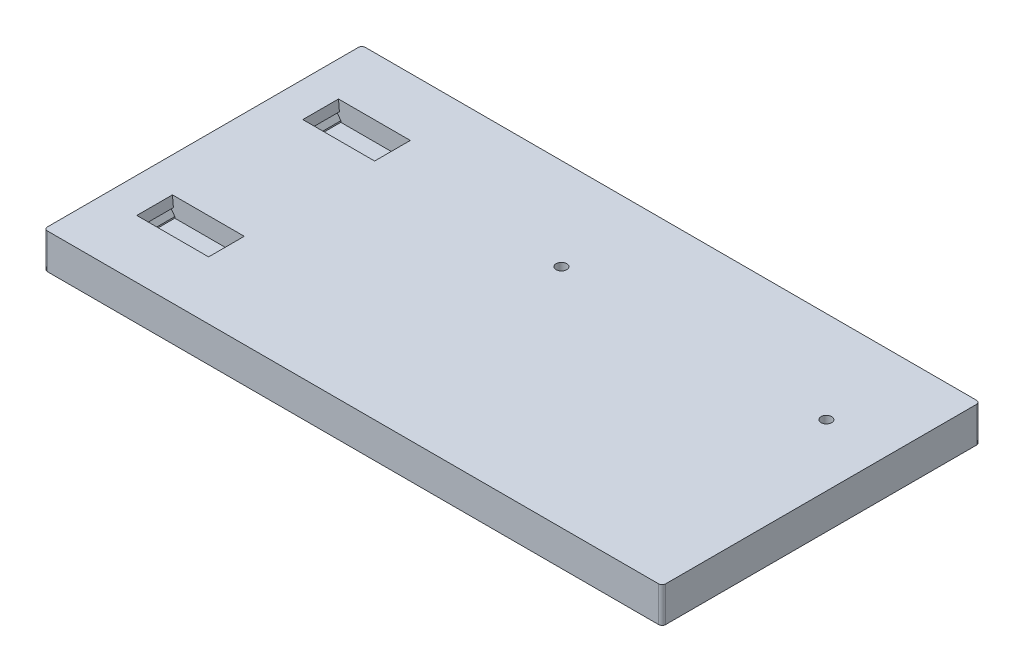
ISO-10303-21;
HEADER;
FILE_DESCRIPTION(('STEP AP214'),'2;1');
FILE_NAME('part.step','',(''),(''),'','','');
FILE_SCHEMA(('AUTOMOTIVE_DESIGN { 1 0 10303 214 1 1 1 1 }'));
ENDSEC;
DATA;
#1=APPLICATION_CONTEXT('core data for automotive mechanical design processes');
#2=APPLICATION_PROTOCOL_DEFINITION('international standard','automotive_design',2000,#1);
#3=PRODUCT_CONTEXT('',#1,'mechanical');
#4=PRODUCT('Part','Part','',(#3));
#5=PRODUCT_RELATED_PRODUCT_CATEGORY('part','',(#4));
#6=PRODUCT_DEFINITION_FORMATION('','',#4);
#7=PRODUCT_DEFINITION_CONTEXT('part definition',#1,'design');
#8=PRODUCT_DEFINITION('design','',#6,#7);
#9=PRODUCT_DEFINITION_SHAPE('','',#8);
#10=(LENGTH_UNIT() NAMED_UNIT(*) SI_UNIT(.MILLI.,.METRE.));
#11=(NAMED_UNIT(*) PLANE_ANGLE_UNIT() SI_UNIT($,.RADIAN.));
#12=(NAMED_UNIT(*) SI_UNIT($,.STERADIAN.) SOLID_ANGLE_UNIT());
#13=UNCERTAINTY_MEASURE_WITH_UNIT(LENGTH_MEASURE(1.E-05),#10,'distance_accuracy_value','');
#14=(GEOMETRIC_REPRESENTATION_CONTEXT(3) GLOBAL_UNCERTAINTY_ASSIGNED_CONTEXT((#13)) GLOBAL_UNIT_ASSIGNED_CONTEXT((#10,
#11,#12)) REPRESENTATION_CONTEXT('',''));
#15=CARTESIAN_POINT('',(0.,0.,0.));
#16=DIRECTION('',(0.,0.,1.));
#17=DIRECTION('',(1.,0.,0.));
#18=AXIS2_PLACEMENT_3D('',#15,#16,#17);
#19=CARTESIAN_POINT('',(0.,10.,0.));
#20=DIRECTION('',(0.,1.,0.));
#21=DIRECTION('',(0.,0.,1.));
#22=AXIS2_PLACEMENT_3D('',#19,#20,#21);
#23=PLANE('',#22);
#24=CARTESIAN_POINT('',(-4.99999999999998,10.,-19.));
#25=DIRECTION('',(0.,1.,0.));
#26=DIRECTION('',(0.,0.,1.));
#27=AXIS2_PLACEMENT_3D('',#24,#25,#26);
#28=CIRCLE('',#27,1.5);
#29=CARTESIAN_POINT('',(-4.99999999999998,10.,-17.5));
#30=VERTEX_POINT('',#29);
#31=EDGE_CURVE('E942',#30,#30,#28,.T.);
#32=ORIENTED_EDGE('',*,*,#31,.F.);
#33=EDGE_LOOP('',(#32));
#34=FACE_BOUND('',#33,.T.);
#35=CARTESIAN_POINT('',(70.,10.,-19.));
#36=DIRECTION('',(0.,1.,0.));
#37=DIRECTION('',(0.,0.,1.));
#38=AXIS2_PLACEMENT_3D('',#35,#36,#37);
#39=CIRCLE('',#38,1.5);
#40=CARTESIAN_POINT('',(70.,10.,-17.5));
#41=VERTEX_POINT('',#40);
#42=EDGE_CURVE('E938',#41,#41,#39,.T.);
#43=ORIENTED_EDGE('',*,*,#42,.F.);
#44=EDGE_LOOP('',(#43));
#45=FACE_BOUND('',#44,.T.);
#46=DIRECTION('',(0.,0.,1.));
#47=VECTOR('',#46,1.);
#48=CARTESIAN_POINT('',(-77.6628810669972,10.,-70.6424139267072));
#49=LINE('',#48,#47);
#50=CARTESIAN_POINT('',(-77.6628810669972,10.,-28.55));
#51=VERTEX_POINT('',#50);
#52=CARTESIAN_POINT('',(-77.6628810669972,10.,-18.45));
#53=VERTEX_POINT('',#52);
#54=EDGE_CURVE('E242',#51,#53,#49,.T.);
#55=ORIENTED_EDGE('',*,*,#54,.F.);
#56=DIRECTION('',(1.,0.,0.));
#57=VECTOR('',#56,1.);
#58=CARTESIAN_POINT('',(0.,10.,-28.55));
#59=LINE('',#58,#57);
#60=CARTESIAN_POINT('',(-57.3371189330027,10.,-28.55));
#61=VERTEX_POINT('',#60);
#62=EDGE_CURVE('E854',#51,#61,#59,.T.);
#63=ORIENTED_EDGE('',*,*,#62,.T.);
#64=DIRECTION('',(0.,0.,1.));
#65=VECTOR('',#64,1.);
#66=CARTESIAN_POINT('',(-57.3371189330027,10.,-70.6424139267072));
#67=LINE('',#66,#65);
#68=CARTESIAN_POINT('',(-57.3371189330027,10.,-18.45));
#69=VERTEX_POINT('',#68);
#70=EDGE_CURVE('E857',#61,#69,#67,.T.);
#71=ORIENTED_EDGE('',*,*,#70,.T.);
#72=DIRECTION('',(1.,0.,0.));
#73=VECTOR('',#72,1.);
#74=CARTESIAN_POINT('',(0.,10.,-18.45));
#75=LINE('',#74,#73);
#76=EDGE_CURVE('E841',#53,#69,#75,.T.);
#77=ORIENTED_EDGE('',*,*,#76,.F.);
#78=EDGE_LOOP('',(#55,#63,#71,#77));
#79=FACE_BOUND('',#78,.T.);
#80=DIRECTION('',(-1.,0.,0.));
#81=VECTOR('',#80,1.);
#82=CARTESIAN_POINT('',(87.5,10.,-45.));
#83=LINE('',#82,#81);
#84=CARTESIAN_POINT('',(86.5,10.,-45.));
#85=VERTEX_POINT('',#84);
#86=CARTESIAN_POINT('',(-86.5,10.,-45.));
#87=VERTEX_POINT('',#86);
#88=EDGE_CURVE('E394',#85,#87,#83,.T.);
#89=ORIENTED_EDGE('',*,*,#88,.T.);
#90=CARTESIAN_POINT('',(-86.5,10.,-44.));
#91=DIRECTION('',(0.,1.,0.));
#92=DIRECTION('',(0.,0.,1.));
#93=AXIS2_PLACEMENT_3D('',#90,#91,#92);
#94=CIRCLE('',#93,1.);
#95=CARTESIAN_POINT('',(-87.5,10.,-44.));
#96=VERTEX_POINT('',#95);
#97=EDGE_CURVE('E445',#87,#96,#94,.T.);
#98=ORIENTED_EDGE('',*,*,#97,.T.);
#99=DIRECTION('',(0.,0.,1.));
#100=VECTOR('',#99,1.);
#101=CARTESIAN_POINT('',(-87.5,10.,45.));
#102=LINE('',#101,#100);
#103=CARTESIAN_POINT('',(-87.5,10.,44.));
#104=VERTEX_POINT('',#103);
#105=EDGE_CURVE('E383',#96,#104,#102,.T.);
#106=ORIENTED_EDGE('',*,*,#105,.T.);
#107=CARTESIAN_POINT('',(-86.5,10.,44.));
#108=DIRECTION('',(0.,1.,0.));
#109=DIRECTION('',(0.,0.,1.));
#110=AXIS2_PLACEMENT_3D('',#107,#108,#109);
#111=CIRCLE('',#110,1.);
#112=CARTESIAN_POINT('',(-86.5,10.,45.));
#113=VERTEX_POINT('',#112);
#114=EDGE_CURVE('E437',#104,#113,#111,.T.);
#115=ORIENTED_EDGE('',*,*,#114,.T.);
#116=DIRECTION('',(1.,0.,0.));
#117=VECTOR('',#116,1.);
#118=CARTESIAN_POINT('',(87.5,10.,45.));
#119=LINE('',#118,#117);
#120=CARTESIAN_POINT('',(86.5,10.,45.));
#121=VERTEX_POINT('',#120);
#122=EDGE_CURVE('E387',#113,#121,#119,.T.);
#123=ORIENTED_EDGE('',*,*,#122,.T.);
#124=CARTESIAN_POINT('',(86.5,10.,44.));
#125=DIRECTION('',(0.,1.,0.));
#126=DIRECTION('',(0.,0.,1.));
#127=AXIS2_PLACEMENT_3D('',#124,#125,#126);
#128=CIRCLE('',#127,1.);
#129=CARTESIAN_POINT('',(87.5,10.,44.));
#130=VERTEX_POINT('',#129);
#131=EDGE_CURVE('E68',#121,#130,#128,.T.);
#132=ORIENTED_EDGE('',*,*,#131,.T.);
#133=DIRECTION('',(0.,0.,-1.));
#134=VECTOR('',#133,1.);
#135=CARTESIAN_POINT('',(87.5,10.,45.));
#136=LINE('',#135,#134);
#137=CARTESIAN_POINT('',(87.5,10.,-44.));
#138=VERTEX_POINT('',#137);
#139=EDGE_CURVE('E391',#130,#138,#136,.T.);
#140=ORIENTED_EDGE('',*,*,#139,.T.);
#141=CARTESIAN_POINT('',(86.5,10.,-44.));
#142=DIRECTION('',(0.,1.,0.));
#143=DIRECTION('',(0.,0.,1.));
#144=AXIS2_PLACEMENT_3D('',#141,#142,#143);
#145=CIRCLE('',#144,1.);
#146=EDGE_CURVE('E442',#138,#85,#145,.T.);
#147=ORIENTED_EDGE('',*,*,#146,.T.);
#148=EDGE_LOOP('',(#89,#98,#106,#115,#123,#132,#140,#147));
#149=FACE_BOUND('',#148,.T.);
#150=DIRECTION('',(0.,0.,-1.));
#151=VECTOR('',#150,1.);
#152=CARTESIAN_POINT('',(-77.6628810669972,10.,33.7424139267072));
#153=LINE('',#152,#151);
#154=CARTESIAN_POINT('',(-77.6628810669972,10.,28.55));
#155=VERTEX_POINT('',#154);
#156=CARTESIAN_POINT('',(-77.6628810669972,10.,18.45));
#157=VERTEX_POINT('',#156);
#158=EDGE_CURVE('E276',#155,#157,#153,.T.);
#159=ORIENTED_EDGE('',*,*,#158,.T.);
#160=DIRECTION('',(1.,0.,0.));
#161=VECTOR('',#160,1.);
#162=CARTESIAN_POINT('',(0.,10.,18.45));
#163=LINE('',#162,#161);
#164=CARTESIAN_POINT('',(-57.3371189330027,10.,18.45));
#165=VERTEX_POINT('',#164);
#166=EDGE_CURVE('E352',#157,#165,#163,.T.);
#167=ORIENTED_EDGE('',*,*,#166,.T.);
#168=DIRECTION('',(0.,0.,-1.));
#169=VECTOR('',#168,1.);
#170=CARTESIAN_POINT('',(-57.3371189330027,10.,33.7424139267072));
#171=LINE('',#170,#169);
#172=CARTESIAN_POINT('',(-57.3371189330027,10.,28.55));
#173=VERTEX_POINT('',#172);
#174=EDGE_CURVE('E313',#173,#165,#171,.T.);
#175=ORIENTED_EDGE('',*,*,#174,.F.);
#176=DIRECTION('',(1.,0.,0.));
#177=VECTOR('',#176,1.);
#178=CARTESIAN_POINT('',(0.,10.,28.55));
#179=LINE('',#178,#177);
#180=EDGE_CURVE('E290',#155,#173,#179,.T.);
#181=ORIENTED_EDGE('',*,*,#180,.F.);
#182=EDGE_LOOP('',(#159,#167,#175,#181));
#183=FACE_BOUND('',#182,.T.);
#184=ADVANCED_FACE('F45',(#34,#45,#79,#149,#183),#23,.T.);
#185=CARTESIAN_POINT('',(-77.,4.6,0.));
#186=DIRECTION('',(1.,0.,0.));
#187=DIRECTION('',(0.,0.,-1.));
#188=AXIS2_PLACEMENT_3D('',#185,#186,#187);
#189=PLANE('',#188);
#190=DIRECTION('',(0.,1.,0.));
#191=VECTOR('',#190,1.);
#192=CARTESIAN_POINT('',(-77.,4.6,18.45));
#193=LINE('',#192,#191);
#194=CARTESIAN_POINT('',(-77.,4.6,18.45));
#195=VERTEX_POINT('',#194);
#196=CARTESIAN_POINT('',(-77.,5.,18.45));
#197=VERTEX_POINT('',#196);
#198=EDGE_CURVE('E372',#195,#197,#193,.T.);
#199=ORIENTED_EDGE('',*,*,#198,.T.);
#200=DIRECTION('',(0.,0.,-1.));
#201=VECTOR('',#200,1.);
#202=CARTESIAN_POINT('',(-77.,5.,33.7424139267072));
#203=LINE('',#202,#201);
#204=CARTESIAN_POINT('',(-77.,5.,28.55));
#205=VERTEX_POINT('',#204);
#206=EDGE_CURVE('E280',#205,#197,#203,.T.);
#207=ORIENTED_EDGE('',*,*,#206,.F.);
#208=DIRECTION('',(0.,1.,0.));
#209=VECTOR('',#208,1.);
#210=CARTESIAN_POINT('',(-77.,4.6,28.55));
#211=LINE('',#210,#209);
#212=CARTESIAN_POINT('',(-77.,4.6,28.55));
#213=VERTEX_POINT('',#212);
#214=EDGE_CURVE('E367',#213,#205,#211,.T.);
#215=ORIENTED_EDGE('',*,*,#214,.F.);
#216=DIRECTION('',(0.,0.,-1.));
#217=VECTOR('',#216,1.);
#218=CARTESIAN_POINT('',(-77.,4.6,0.));
#219=LINE('',#218,#217);
#220=EDGE_CURVE('E359',#213,#195,#219,.T.);
#221=ORIENTED_EDGE('',*,*,#220,.T.);
#222=EDGE_LOOP('',(#199,#207,#215,#221));
#223=FACE_BOUND('',#222,.T.);
#224=ADVANCED_FACE('F499',(#223),#189,.T.);
#225=CARTESIAN_POINT('',(-58.,4.6,0.));
#226=DIRECTION('',(1.,0.,0.));
#227=DIRECTION('',(0.,0.,-1.));
#228=AXIS2_PLACEMENT_3D('',#225,#226,#227);
#229=PLANE('',#228);
#230=DIRECTION('',(0.,0.,-1.));
#231=VECTOR('',#230,1.);
#232=CARTESIAN_POINT('',(-58.,5.,33.7424139267072));
#233=LINE('',#232,#231);
#234=CARTESIAN_POINT('',(-58.,5.,28.55));
#235=VERTEX_POINT('',#234);
#236=CARTESIAN_POINT('',(-58.,5.,18.45));
#237=VERTEX_POINT('',#236);
#238=EDGE_CURVE('E308',#235,#237,#233,.T.);
#239=ORIENTED_EDGE('',*,*,#238,.T.);
#240=DIRECTION('',(0.,1.,0.));
#241=VECTOR('',#240,1.);
#242=CARTESIAN_POINT('',(-58.,4.6,18.45));
#243=LINE('',#242,#241);
#244=CARTESIAN_POINT('',(-58.,4.6,18.45));
#245=VERTEX_POINT('',#244);
#246=EDGE_CURVE('E376',#245,#237,#243,.T.);
#247=ORIENTED_EDGE('',*,*,#246,.F.);
#248=DIRECTION('',(0.,0.,-1.));
#249=VECTOR('',#248,1.);
#250=CARTESIAN_POINT('',(-58.,4.6,0.));
#251=LINE('',#250,#249);
#252=CARTESIAN_POINT('',(-58.,4.6,28.55));
#253=VERTEX_POINT('',#252);
#254=EDGE_CURVE('E351',#253,#245,#251,.T.);
#255=ORIENTED_EDGE('',*,*,#254,.F.);
#256=DIRECTION('',(0.,1.,0.));
#257=VECTOR('',#256,1.);
#258=CARTESIAN_POINT('',(-58.,4.6,28.55));
#259=LINE('',#258,#257);
#260=EDGE_CURVE('E362',#253,#235,#259,.T.);
#261=ORIENTED_EDGE('',*,*,#260,.T.);
#262=EDGE_LOOP('',(#239,#247,#255,#261));
#263=FACE_BOUND('',#262,.T.);
#264=ADVANCED_FACE('F506',(#263),#229,.F.);
#265=CARTESIAN_POINT('',(-87.5,10.,45.));
#266=DIRECTION('',(1.,0.,0.));
#267=DIRECTION('',(0.,0.,-1.));
#268=AXIS2_PLACEMENT_3D('',#265,#266,#267);
#269=PLANE('',#268);
#270=ORIENTED_EDGE('',*,*,#105,.F.);
#271=DIRECTION('',(0.,-1.,0.));
#272=VECTOR('',#271,1.);
#273=CARTESIAN_POINT('',(-87.5,10.,-44.));
#274=LINE('',#273,#272);
#275=CARTESIAN_POINT('',(-87.5,0.,-44.));
#276=VERTEX_POINT('',#275);
#277=EDGE_CURVE('E414',#96,#276,#274,.T.);
#278=ORIENTED_EDGE('',*,*,#277,.T.);
#279=DIRECTION('',(0.,0.,1.));
#280=VECTOR('',#279,1.);
#281=CARTESIAN_POINT('',(-87.5,0.,45.));
#282=LINE('',#281,#280);
#283=CARTESIAN_POINT('',(-87.5,0.,44.));
#284=VERTEX_POINT('',#283);
#285=EDGE_CURVE('E371',#276,#284,#282,.T.);
#286=ORIENTED_EDGE('',*,*,#285,.T.);
#287=DIRECTION('',(0.,-1.,0.));
#288=VECTOR('',#287,1.);
#289=CARTESIAN_POINT('',(-87.5,10.,44.));
#290=LINE('',#289,#288);
#291=EDGE_CURVE('E398',#284,#104,#290,.F.);
#292=ORIENTED_EDGE('',*,*,#291,.T.);
#293=EDGE_LOOP('',(#270,#278,#286,#292));
#294=FACE_BOUND('',#293,.T.);
#295=ADVANCED_FACE('F487',(#294),#269,.F.);
#296=CARTESIAN_POINT('',(87.5,10.,45.));
#297=DIRECTION('',(0.,0.,-1.));
#298=DIRECTION('',(-1.,0.,0.));
#299=AXIS2_PLACEMENT_3D('',#296,#297,#298);
#300=PLANE('',#299);
#301=DIRECTION('',(1.,0.,0.));
#302=VECTOR('',#301,1.);
#303=CARTESIAN_POINT('',(87.5,0.,45.));
#304=LINE('',#303,#302);
#305=CARTESIAN_POINT('',(-86.5,0.,45.));
#306=VERTEX_POINT('',#305);
#307=CARTESIAN_POINT('',(86.5,0.,45.));
#308=VERTEX_POINT('',#307);
#309=EDGE_CURVE('E402',#306,#308,#304,.T.);
#310=ORIENTED_EDGE('',*,*,#309,.T.);
#311=DIRECTION('',(0.,-1.,0.));
#312=VECTOR('',#311,1.);
#313=CARTESIAN_POINT('',(86.5,10.,45.));
#314=LINE('',#313,#312);
#315=EDGE_CURVE('E11',#308,#121,#314,.F.);
#316=ORIENTED_EDGE('',*,*,#315,.T.);
#317=ORIENTED_EDGE('',*,*,#122,.F.);
#318=DIRECTION('',(0.,-1.,0.));
#319=VECTOR('',#318,1.);
#320=CARTESIAN_POINT('',(-86.5,10.,45.));
#321=LINE('',#320,#319);
#322=EDGE_CURVE('E54',#113,#306,#321,.T.);
#323=ORIENTED_EDGE('',*,*,#322,.T.);
#324=EDGE_LOOP('',(#310,#316,#317,#323));
#325=FACE_BOUND('',#324,.T.);
#326=ADVANCED_FACE('F459',(#325),#300,.F.);
#327=CARTESIAN_POINT('',(87.5,10.,45.));
#328=DIRECTION('',(-1.,0.,0.));
#329=DIRECTION('',(0.,0.,1.));
#330=AXIS2_PLACEMENT_3D('',#327,#328,#329);
#331=PLANE('',#330);
#332=DIRECTION('',(0.,0.,-1.));
#333=VECTOR('',#332,1.);
#334=CARTESIAN_POINT('',(87.5,0.,45.));
#335=LINE('',#334,#333);
#336=CARTESIAN_POINT('',(87.5,0.,44.));
#337=VERTEX_POINT('',#336);
#338=CARTESIAN_POINT('',(87.5,0.,-44.));
#339=VERTEX_POINT('',#338);
#340=EDGE_CURVE('E406',#337,#339,#335,.T.);
#341=ORIENTED_EDGE('',*,*,#340,.T.);
#342=DIRECTION('',(0.,-1.,0.));
#343=VECTOR('',#342,1.);
#344=CARTESIAN_POINT('',(87.5,10.,-44.));
#345=LINE('',#344,#343);
#346=EDGE_CURVE('E61',#339,#138,#345,.F.);
#347=ORIENTED_EDGE('',*,*,#346,.T.);
#348=ORIENTED_EDGE('',*,*,#139,.F.);
#349=DIRECTION('',(0.,-1.,0.));
#350=VECTOR('',#349,1.);
#351=CARTESIAN_POINT('',(87.5,10.,44.));
#352=LINE('',#351,#350);
#353=EDGE_CURVE('E448',#130,#337,#352,.T.);
#354=ORIENTED_EDGE('',*,*,#353,.T.);
#355=EDGE_LOOP('',(#341,#347,#348,#354));
#356=FACE_BOUND('',#355,.T.);
#357=ADVANCED_FACE('F470',(#356),#331,.F.);
#358=CARTESIAN_POINT('',(87.5,10.,-45.));
#359=DIRECTION('',(0.,0.,1.));
#360=DIRECTION('',(1.,0.,0.));
#361=AXIS2_PLACEMENT_3D('',#358,#359,#360);
#362=PLANE('',#361);
#363=DIRECTION('',(-1.,0.,0.));
#364=VECTOR('',#363,1.);
#365=CARTESIAN_POINT('',(87.5,0.,-45.));
#366=LINE('',#365,#364);
#367=CARTESIAN_POINT('',(86.5,0.,-45.));
#368=VERTEX_POINT('',#367);
#369=CARTESIAN_POINT('',(-86.5,0.,-45.));
#370=VERTEX_POINT('',#369);
#371=EDGE_CURVE('E388',#368,#370,#366,.T.);
#372=ORIENTED_EDGE('',*,*,#371,.T.);
#373=DIRECTION('',(0.,-1.,0.));
#374=VECTOR('',#373,1.);
#375=CARTESIAN_POINT('',(-86.5,10.,-45.));
#376=LINE('',#375,#374);
#377=EDGE_CURVE('E434',#370,#87,#376,.F.);
#378=ORIENTED_EDGE('',*,*,#377,.T.);
#379=ORIENTED_EDGE('',*,*,#88,.F.);
#380=DIRECTION('',(0.,-1.,0.));
#381=VECTOR('',#380,1.);
#382=CARTESIAN_POINT('',(86.5,10.,-45.));
#383=LINE('',#382,#381);
#384=EDGE_CURVE('E430',#85,#368,#383,.T.);
#385=ORIENTED_EDGE('',*,*,#384,.T.);
#386=EDGE_LOOP('',(#372,#378,#379,#385));
#387=FACE_BOUND('',#386,.T.);
#388=ADVANCED_FACE('F479',(#387),#362,.F.);
#389=CARTESIAN_POINT('',(0.,0.,0.));
#390=DIRECTION('',(0.,1.,0.));
#391=DIRECTION('',(0.,0.,1.));
#392=AXIS2_PLACEMENT_3D('',#389,#390,#391);
#393=PLANE('',#392);
#394=CARTESIAN_POINT('',(-4.99999999999998,0.,-19.));
#395=DIRECTION('',(0.,1.,0.));
#396=DIRECTION('',(0.,0.,1.));
#397=AXIS2_PLACEMENT_3D('',#394,#395,#396);
#398=CIRCLE('',#397,1.5);
#399=CARTESIAN_POINT('',(-4.99999999999998,0.,-17.5));
#400=VERTEX_POINT('',#399);
#401=EDGE_CURVE('E911',#400,#400,#398,.T.);
#402=ORIENTED_EDGE('',*,*,#401,.T.);
#403=EDGE_LOOP('',(#402));
#404=FACE_BOUND('',#403,.T.);
#405=CARTESIAN_POINT('',(70.,0.,-19.));
#406=DIRECTION('',(0.,1.,0.));
#407=DIRECTION('',(0.,0.,1.));
#408=AXIS2_PLACEMENT_3D('',#405,#406,#407);
#409=CIRCLE('',#408,1.5);
#410=CARTESIAN_POINT('',(70.,0.,-17.5));
#411=VERTEX_POINT('',#410);
#412=EDGE_CURVE('E934',#411,#411,#409,.T.);
#413=ORIENTED_EDGE('',*,*,#412,.T.);
#414=EDGE_LOOP('',(#413));
#415=FACE_BOUND('',#414,.T.);
#416=ORIENTED_EDGE('',*,*,#285,.F.);
#417=CARTESIAN_POINT('',(-86.5,0.,-44.));
#418=DIRECTION('',(0.,1.,0.));
#419=DIRECTION('',(0.,0.,1.));
#420=AXIS2_PLACEMENT_3D('',#417,#418,#419);
#421=CIRCLE('',#420,1.);
#422=EDGE_CURVE('E427',#276,#370,#421,.F.);
#423=ORIENTED_EDGE('',*,*,#422,.T.);
#424=ORIENTED_EDGE('',*,*,#371,.F.);
#425=CARTESIAN_POINT('',(86.5,0.,-44.));
#426=DIRECTION('',(0.,1.,0.));
#427=DIRECTION('',(0.,0.,1.));
#428=AXIS2_PLACEMENT_3D('',#425,#426,#427);
#429=CIRCLE('',#428,1.);
#430=EDGE_CURVE('E424',#368,#339,#429,.F.);
#431=ORIENTED_EDGE('',*,*,#430,.T.);
#432=ORIENTED_EDGE('',*,*,#340,.F.);
#433=CARTESIAN_POINT('',(86.5,0.,44.));
#434=DIRECTION('',(0.,1.,0.));
#435=DIRECTION('',(0.,0.,1.));
#436=AXIS2_PLACEMENT_3D('',#433,#434,#435);
#437=CIRCLE('',#436,1.);
#438=EDGE_CURVE('E421',#337,#308,#437,.F.);
#439=ORIENTED_EDGE('',*,*,#438,.T.);
#440=ORIENTED_EDGE('',*,*,#309,.F.);
#441=CARTESIAN_POINT('',(-86.5,0.,44.));
#442=DIRECTION('',(0.,1.,0.));
#443=DIRECTION('',(0.,0.,1.));
#444=AXIS2_PLACEMENT_3D('',#441,#442,#443);
#445=CIRCLE('',#444,1.);
#446=EDGE_CURVE('E418',#306,#284,#445,.F.);
#447=ORIENTED_EDGE('',*,*,#446,.T.);
#448=EDGE_LOOP('',(#416,#423,#424,#431,#432,#439,#440,#447));
#449=FACE_BOUND('',#448,.T.);
#450=ADVANCED_FACE('F465',(#404,#415,#449),#393,.F.);
#451=CARTESIAN_POINT('',(0.,4.6,28.55));
#452=DIRECTION('',(0.,0.,1.));
#453=DIRECTION('',(1.,0.,0.));
#454=AXIS2_PLACEMENT_3D('',#451,#452,#453);
#455=PLANE('',#454);
#456=ORIENTED_EDGE('',*,*,#180,.T.);
#457=DIRECTION('',(0.0871557427476641,0.996194698091745,0.));
#458=VECTOR('',#457,1.);
#459=CARTESIAN_POINT('',(-57.5995849235805,7.,28.55));
#460=LINE('',#459,#458);
#461=CARTESIAN_POINT('',(-57.5995849235805,7.,28.55));
#462=VERTEX_POINT('',#461);
#463=EDGE_CURVE('E333',#462,#173,#460,.T.);
#464=ORIENTED_EDGE('',*,*,#463,.F.);
#465=DIRECTION('',(-1.,0.,0.));
#466=VECTOR('',#465,1.);
#467=CARTESIAN_POINT('',(-56.5995849235805,7.,28.55));
#468=LINE('',#467,#466);
#469=CARTESIAN_POINT('',(-56.5995849235805,7.,28.55));
#470=VERTEX_POINT('',#469);
#471=EDGE_CURVE('E329',#470,#462,#468,.T.);
#472=ORIENTED_EDGE('',*,*,#471,.F.);
#473=DIRECTION('',(0.573576436351052,0.819152044288988,0.));
#474=VECTOR('',#473,1.);
#475=CARTESIAN_POINT('',(-58.,5.,28.55));
#476=LINE('',#475,#474);
#477=EDGE_CURVE('E318',#235,#470,#476,.T.);
#478=ORIENTED_EDGE('',*,*,#477,.F.);
#479=ORIENTED_EDGE('',*,*,#260,.F.);
#480=DIRECTION('',(1.,0.,0.));
#481=VECTOR('',#480,1.);
#482=CARTESIAN_POINT('',(0.,4.6,28.55));
#483=LINE('',#482,#481);
#484=EDGE_CURVE('E347',#213,#253,#483,.T.);
#485=ORIENTED_EDGE('',*,*,#484,.F.);
#486=ORIENTED_EDGE('',*,*,#214,.T.);
#487=DIRECTION('',(0.573576436351049,-0.81915204428899,0.));
#488=VECTOR('',#487,1.);
#489=CARTESIAN_POINT('',(-77.,5.,28.55));
#490=LINE('',#489,#488);
#491=CARTESIAN_POINT('',(-78.4004150764194,7.,28.55));
#492=VERTEX_POINT('',#491);
#493=EDGE_CURVE('E287',#492,#205,#490,.T.);
#494=ORIENTED_EDGE('',*,*,#493,.F.);
#495=DIRECTION('',(-1.,0.,0.));
#496=VECTOR('',#495,1.);
#497=CARTESIAN_POINT('',(-78.4004150764194,7.,28.55));
#498=LINE('',#497,#496);
#499=CARTESIAN_POINT('',(-77.4004150764194,7.,28.55));
#500=VERTEX_POINT('',#499);
#501=EDGE_CURVE('E291',#500,#492,#498,.T.);
#502=ORIENTED_EDGE('',*,*,#501,.F.);
#503=DIRECTION('',(0.0871557427476595,-0.996194698091746,0.));
#504=VECTOR('',#503,1.);
#505=CARTESIAN_POINT('',(-77.4004150764194,7.,28.55));
#506=LINE('',#505,#504);
#507=EDGE_CURVE('E275',#155,#500,#506,.T.);
#508=ORIENTED_EDGE('',*,*,#507,.F.);
#509=EDGE_LOOP('',(#456,#464,#472,#478,#479,#485,#486,#494,#502,#508));
#510=FACE_BOUND('',#509,.T.);
#511=ADVANCED_FACE('F513',(#510),#455,.F.);
#512=CARTESIAN_POINT('',(0.,4.6,18.45));
#513=DIRECTION('',(0.,0.,1.));
#514=DIRECTION('',(1.,0.,0.));
#515=AXIS2_PLACEMENT_3D('',#512,#513,#514);
#516=PLANE('',#515);
#517=ORIENTED_EDGE('',*,*,#166,.F.);
#518=DIRECTION('',(0.0871557427476595,-0.996194698091745,0.));
#519=VECTOR('',#518,1.);
#520=CARTESIAN_POINT('',(-77.4004150764194,7.,18.45));
#521=LINE('',#520,#519);
#522=CARTESIAN_POINT('',(-77.4004150764194,7.,18.45));
#523=VERTEX_POINT('',#522);
#524=EDGE_CURVE('E271',#157,#523,#521,.T.);
#525=ORIENTED_EDGE('',*,*,#524,.T.);
#526=DIRECTION('',(-1.,0.,0.));
#527=VECTOR('',#526,1.);
#528=CARTESIAN_POINT('',(-78.4004150764194,7.,18.45));
#529=LINE('',#528,#527);
#530=CARTESIAN_POINT('',(-78.4004150764194,7.,18.45));
#531=VERTEX_POINT('',#530);
#532=EDGE_CURVE('E282',#523,#531,#529,.T.);
#533=ORIENTED_EDGE('',*,*,#532,.T.);
#534=DIRECTION('',(0.573576436351048,-0.81915204428899,0.));
#535=VECTOR('',#534,1.);
#536=CARTESIAN_POINT('',(-77.,5.,18.45));
#537=LINE('',#536,#535);
#538=EDGE_CURVE('E277',#531,#197,#537,.T.);
#539=ORIENTED_EDGE('',*,*,#538,.T.);
#540=ORIENTED_EDGE('',*,*,#198,.F.);
#541=DIRECTION('',(1.,0.,0.));
#542=VECTOR('',#541,1.);
#543=CARTESIAN_POINT('',(0.,4.6,18.45));
#544=LINE('',#543,#542);
#545=EDGE_CURVE('E356',#195,#245,#544,.T.);
#546=ORIENTED_EDGE('',*,*,#545,.T.);
#547=ORIENTED_EDGE('',*,*,#246,.T.);
#548=DIRECTION('',(0.573576436351052,0.819152044288987,0.));
#549=VECTOR('',#548,1.);
#550=CARTESIAN_POINT('',(-58.,5.,18.45));
#551=LINE('',#550,#549);
#552=CARTESIAN_POINT('',(-56.5995849235805,7.,18.45));
#553=VERTEX_POINT('',#552);
#554=EDGE_CURVE('E312',#237,#553,#551,.T.);
#555=ORIENTED_EDGE('',*,*,#554,.T.);
#556=DIRECTION('',(-1.,0.,0.));
#557=VECTOR('',#556,1.);
#558=CARTESIAN_POINT('',(-56.5995849235805,7.,18.45));
#559=LINE('',#558,#557);
#560=CARTESIAN_POINT('',(-57.5995849235805,7.,18.45));
#561=VERTEX_POINT('',#560);
#562=EDGE_CURVE('E322',#553,#561,#559,.T.);
#563=ORIENTED_EDGE('',*,*,#562,.T.);
#564=DIRECTION('',(0.0871557427476641,0.996194698091745,0.));
#565=VECTOR('',#564,1.);
#566=CARTESIAN_POINT('',(-57.5995849235805,7.,18.45));
#567=LINE('',#566,#565);
#568=EDGE_CURVE('E317',#561,#165,#567,.T.);
#569=ORIENTED_EDGE('',*,*,#568,.T.);
#570=EDGE_LOOP('',(#517,#525,#533,#539,#540,#546,#547,#555,#563,#569));
#571=FACE_BOUND('',#570,.T.);
#572=ADVANCED_FACE('F627',(#571),#516,.T.);
#573=CARTESIAN_POINT('',(0.,4.6,0.));
#574=DIRECTION('',(0.,1.,0.));
#575=DIRECTION('',(0.,0.,1.));
#576=AXIS2_PLACEMENT_3D('',#573,#574,#575);
#577=PLANE('',#576);
#578=ORIENTED_EDGE('',*,*,#484,.T.);
#579=ORIENTED_EDGE('',*,*,#254,.T.);
#580=ORIENTED_EDGE('',*,*,#545,.F.);
#581=ORIENTED_EDGE('',*,*,#220,.F.);
#582=EDGE_LOOP('',(#578,#579,#580,#581));
#583=FACE_BOUND('',#582,.T.);
#584=ADVANCED_FACE('F618',(#583),#577,.T.);
#585=CARTESIAN_POINT('',(-58.,5.,33.7424139267072));
#586=DIRECTION('',(-0.819152044288987,0.573576436351052,0.));
#587=DIRECTION('',(-0.573576436351052,-0.819152044288987,0.));
#588=AXIS2_PLACEMENT_3D('',#585,#586,#587);
#589=PLANE('',#588);
#590=ORIENTED_EDGE('',*,*,#477,.T.);
#591=DIRECTION('',(0.,0.,-1.));
#592=VECTOR('',#591,1.);
#593=CARTESIAN_POINT('',(-56.5995849235805,7.,33.7424139267072));
#594=LINE('',#593,#592);
#595=EDGE_CURVE('E323',#470,#553,#594,.T.);
#596=ORIENTED_EDGE('',*,*,#595,.T.);
#597=ORIENTED_EDGE('',*,*,#554,.F.);
#598=ORIENTED_EDGE('',*,*,#238,.F.);
#599=EDGE_LOOP('',(#590,#596,#597,#598));
#600=FACE_BOUND('',#599,.T.);
#601=ADVANCED_FACE('F614',(#600),#589,.T.);
#602=CARTESIAN_POINT('',(-56.5995849235805,7.,33.7424139267072));
#603=DIRECTION('',(0.,-1.,0.));
#604=DIRECTION('',(0.,0.,-1.));
#605=AXIS2_PLACEMENT_3D('',#602,#603,#604);
#606=PLANE('',#605);
#607=ORIENTED_EDGE('',*,*,#471,.T.);
#608=DIRECTION('',(0.,0.,-1.));
#609=VECTOR('',#608,1.);
#610=CARTESIAN_POINT('',(-57.5995849235805,7.,33.7424139267072));
#611=LINE('',#610,#609);
#612=EDGE_CURVE('E319',#462,#561,#611,.T.);
#613=ORIENTED_EDGE('',*,*,#612,.T.);
#614=ORIENTED_EDGE('',*,*,#562,.F.);
#615=ORIENTED_EDGE('',*,*,#595,.F.);
#616=EDGE_LOOP('',(#607,#613,#614,#615));
#617=FACE_BOUND('',#616,.T.);
#618=ADVANCED_FACE('F617',(#617),#606,.T.);
#619=CARTESIAN_POINT('',(-57.5995849235805,7.,33.7424139267072));
#620=DIRECTION('',(-0.996194698091745,0.0871557427476641,0.));
#621=DIRECTION('',(-0.0871557427476641,-0.996194698091745,0.));
#622=AXIS2_PLACEMENT_3D('',#619,#620,#621);
#623=PLANE('',#622);
#624=ORIENTED_EDGE('',*,*,#463,.T.);
#625=ORIENTED_EDGE('',*,*,#174,.T.);
#626=ORIENTED_EDGE('',*,*,#568,.F.);
#627=ORIENTED_EDGE('',*,*,#612,.F.);
#628=EDGE_LOOP('',(#624,#625,#626,#627));
#629=FACE_BOUND('',#628,.T.);
#630=ADVANCED_FACE('F612',(#629),#623,.T.);
#631=CARTESIAN_POINT('',(-78.4004150764194,7.,33.7424139267072));
#632=DIRECTION('',(0.,-1.,0.));
#633=DIRECTION('',(0.,0.,-1.));
#634=AXIS2_PLACEMENT_3D('',#631,#632,#633);
#635=PLANE('',#634);
#636=ORIENTED_EDGE('',*,*,#501,.T.);
#637=DIRECTION('',(0.,0.,-1.));
#638=VECTOR('',#637,1.);
#639=CARTESIAN_POINT('',(-78.4004150764194,7.,33.7424139267072));
#640=LINE('',#639,#638);
#641=EDGE_CURVE('E281',#492,#531,#640,.T.);
#642=ORIENTED_EDGE('',*,*,#641,.T.);
#643=ORIENTED_EDGE('',*,*,#532,.F.);
#644=DIRECTION('',(0.,0.,-1.));
#645=VECTOR('',#644,1.);
#646=CARTESIAN_POINT('',(-77.4004150764194,7.,33.7424139267072));
#647=LINE('',#646,#645);
#648=EDGE_CURVE('E286',#500,#523,#647,.T.);
#649=ORIENTED_EDGE('',*,*,#648,.F.);
#650=EDGE_LOOP('',(#636,#642,#643,#649));
#651=FACE_BOUND('',#650,.T.);
#652=ADVANCED_FACE('F608',(#651),#635,.T.);
#653=CARTESIAN_POINT('',(-77.,5.,33.7424139267072));
#654=DIRECTION('',(0.81915204428899,0.573576436351049,0.));
#655=DIRECTION('',(-0.573576436351049,0.81915204428899,0.));
#656=AXIS2_PLACEMENT_3D('',#653,#654,#655);
#657=PLANE('',#656);
#658=ORIENTED_EDGE('',*,*,#493,.T.);
#659=ORIENTED_EDGE('',*,*,#206,.T.);
#660=ORIENTED_EDGE('',*,*,#538,.F.);
#661=ORIENTED_EDGE('',*,*,#641,.F.);
#662=EDGE_LOOP('',(#658,#659,#660,#661));
#663=FACE_BOUND('',#662,.T.);
#664=ADVANCED_FACE('F604',(#663),#657,.T.);
#665=CARTESIAN_POINT('',(-77.4004150764194,7.,33.7424139267072));
#666=DIRECTION('',(0.996194698091745,0.0871557427476595,0.));
#667=DIRECTION('',(-0.0871557427476595,0.996194698091745,0.));
#668=AXIS2_PLACEMENT_3D('',#665,#666,#667);
#669=PLANE('',#668);
#670=ORIENTED_EDGE('',*,*,#507,.T.);
#671=ORIENTED_EDGE('',*,*,#648,.T.);
#672=ORIENTED_EDGE('',*,*,#524,.F.);
#673=ORIENTED_EDGE('',*,*,#158,.F.);
#674=EDGE_LOOP('',(#670,#671,#672,#673));
#675=FACE_BOUND('',#674,.T.);
#676=ADVANCED_FACE('F601',(#675),#669,.T.);
#677=CARTESIAN_POINT('',(0.,4.6,-28.55));
#678=DIRECTION('',(0.,0.,1.));
#679=DIRECTION('',(1.,0.,0.));
#680=AXIS2_PLACEMENT_3D('',#677,#678,#679);
#681=PLANE('',#680);
#682=ORIENTED_EDGE('',*,*,#62,.F.);
#683=DIRECTION('',(0.0871557427476595,-0.996194698091746,0.));
#684=VECTOR('',#683,1.);
#685=CARTESIAN_POINT('',(-77.4004150764194,7.,-28.55));
#686=LINE('',#685,#684);
#687=CARTESIAN_POINT('',(-77.4004150764194,7.,-28.55));
#688=VERTEX_POINT('',#687);
#689=EDGE_CURVE('E919',#51,#688,#686,.T.);
#690=ORIENTED_EDGE('',*,*,#689,.T.);
#691=DIRECTION('',(-1.,0.,0.));
#692=VECTOR('',#691,1.);
#693=CARTESIAN_POINT('',(-78.4004150764194,7.,-28.55));
#694=LINE('',#693,#692);
#695=CARTESIAN_POINT('',(-78.4004150764194,7.,-28.55));
#696=VERTEX_POINT('',#695);
#697=EDGE_CURVE('E250',#688,#696,#694,.T.);
#698=ORIENTED_EDGE('',*,*,#697,.T.);
#699=DIRECTION('',(0.573576436351049,-0.81915204428899,0.));
#700=VECTOR('',#699,1.);
#701=CARTESIAN_POINT('',(-77.,5.,-28.55));
#702=LINE('',#701,#700);
#703=CARTESIAN_POINT('',(-77.,5.,-28.55));
#704=VERTEX_POINT('',#703);
#705=EDGE_CURVE('E234',#696,#704,#702,.T.);
#706=ORIENTED_EDGE('',*,*,#705,.T.);
#707=DIRECTION('',(0.,1.,0.));
#708=VECTOR('',#707,1.);
#709=CARTESIAN_POINT('',(-77.,4.6,-28.55));
#710=LINE('',#709,#708);
#711=CARTESIAN_POINT('',(-77.,4.6,-28.55));
#712=VERTEX_POINT('',#711);
#713=EDGE_CURVE('E247',#712,#704,#710,.T.);
#714=ORIENTED_EDGE('',*,*,#713,.F.);
#715=DIRECTION('',(1.,0.,0.));
#716=VECTOR('',#715,1.);
#717=CARTESIAN_POINT('',(0.,4.6,-28.55));
#718=LINE('',#717,#716);
#719=CARTESIAN_POINT('',(-58.,4.6,-28.55));
#720=VERTEX_POINT('',#719);
#721=EDGE_CURVE('E853',#712,#720,#718,.T.);
#722=ORIENTED_EDGE('',*,*,#721,.T.);
#723=DIRECTION('',(0.,1.,0.));
#724=VECTOR('',#723,1.);
#725=CARTESIAN_POINT('',(-58.,4.6,-28.55));
#726=LINE('',#725,#724);
#727=CARTESIAN_POINT('',(-58.,5.,-28.55));
#728=VERTEX_POINT('',#727);
#729=EDGE_CURVE('E337',#720,#728,#726,.T.);
#730=ORIENTED_EDGE('',*,*,#729,.T.);
#731=DIRECTION('',(0.573576436351052,0.819152044288988,0.));
#732=VECTOR('',#731,1.);
#733=CARTESIAN_POINT('',(-58.,5.,-28.55));
#734=LINE('',#733,#732);
#735=CARTESIAN_POINT('',(-56.5995849235805,7.,-28.55));
#736=VERTEX_POINT('',#735);
#737=EDGE_CURVE('E872',#728,#736,#734,.T.);
#738=ORIENTED_EDGE('',*,*,#737,.T.);
#739=DIRECTION('',(-1.,0.,0.));
#740=VECTOR('',#739,1.);
#741=CARTESIAN_POINT('',(-56.5995849235805,7.,-28.55));
#742=LINE('',#741,#740);
#743=CARTESIAN_POINT('',(-57.5995849235805,7.,-28.55));
#744=VERTEX_POINT('',#743);
#745=EDGE_CURVE('E862',#736,#744,#742,.T.);
#746=ORIENTED_EDGE('',*,*,#745,.T.);
#747=DIRECTION('',(0.0871557427476641,0.996194698091745,0.));
#748=VECTOR('',#747,1.);
#749=CARTESIAN_POINT('',(-57.5995849235805,7.,-28.55));
#750=LINE('',#749,#748);
#751=EDGE_CURVE('E867',#744,#61,#750,.T.);
#752=ORIENTED_EDGE('',*,*,#751,.T.);
#753=EDGE_LOOP('',(#682,#690,#698,#706,#714,#722,#730,#738,#746,#752));
#754=FACE_BOUND('',#753,.T.);
#755=ADVANCED_FACE('F245',(#754),#681,.T.);
#756=CARTESIAN_POINT('',(-58.,4.6,0.));
#757=DIRECTION('',(-1.,0.,0.));
#758=DIRECTION('',(0.,0.,1.));
#759=AXIS2_PLACEMENT_3D('',#756,#757,#758);
#760=PLANE('',#759);
#761=DIRECTION('',(0.,0.,1.));
#762=VECTOR('',#761,1.);
#763=CARTESIAN_POINT('',(-58.,5.,-70.6424139267072));
#764=LINE('',#763,#762);
#765=CARTESIAN_POINT('',(-58.,5.,-18.45));
#766=VERTEX_POINT('',#765);
#767=EDGE_CURVE('E866',#728,#766,#764,.T.);
#768=ORIENTED_EDGE('',*,*,#767,.F.);
#769=ORIENTED_EDGE('',*,*,#729,.F.);
#770=DIRECTION('',(0.,0.,1.));
#771=VECTOR('',#770,1.);
#772=CARTESIAN_POINT('',(-58.,4.6,0.));
#773=LINE('',#772,#771);
#774=CARTESIAN_POINT('',(-58.,4.6,-18.45));
#775=VERTEX_POINT('',#774);
#776=EDGE_CURVE('E261',#720,#775,#773,.T.);
#777=ORIENTED_EDGE('',*,*,#776,.T.);
#778=DIRECTION('',(0.,1.,0.));
#779=VECTOR('',#778,1.);
#780=CARTESIAN_POINT('',(-58.,4.6,-18.45));
#781=LINE('',#780,#779);
#782=EDGE_CURVE('E265',#775,#766,#781,.T.);
#783=ORIENTED_EDGE('',*,*,#782,.T.);
#784=EDGE_LOOP('',(#768,#769,#777,#783));
#785=FACE_BOUND('',#784,.T.);
#786=ADVANCED_FACE('F589',(#785),#760,.T.);
#787=CARTESIAN_POINT('',(0.,4.6,-18.45));
#788=DIRECTION('',(0.,0.,1.));
#789=DIRECTION('',(1.,0.,0.));
#790=AXIS2_PLACEMENT_3D('',#787,#788,#789);
#791=PLANE('',#790);
#792=ORIENTED_EDGE('',*,*,#76,.T.);
#793=DIRECTION('',(0.0871557427476641,0.996194698091745,0.));
#794=VECTOR('',#793,1.);
#795=CARTESIAN_POINT('',(-57.5995849235805,7.,-18.45));
#796=LINE('',#795,#794);
#797=CARTESIAN_POINT('',(-57.5995849235805,7.,-18.45));
#798=VERTEX_POINT('',#797);
#799=EDGE_CURVE('E844',#798,#69,#796,.T.);
#800=ORIENTED_EDGE('',*,*,#799,.F.);
#801=DIRECTION('',(-1.,0.,0.));
#802=VECTOR('',#801,1.);
#803=CARTESIAN_POINT('',(-56.5995849235805,7.,-18.45));
#804=LINE('',#803,#802);
#805=CARTESIAN_POINT('',(-56.5995849235805,7.,-18.45));
#806=VERTEX_POINT('',#805);
#807=EDGE_CURVE('E863',#806,#798,#804,.T.);
#808=ORIENTED_EDGE('',*,*,#807,.F.);
#809=DIRECTION('',(0.573576436351052,0.819152044288987,0.));
#810=VECTOR('',#809,1.);
#811=CARTESIAN_POINT('',(-58.,5.,-18.45));
#812=LINE('',#811,#810);
#813=EDGE_CURVE('E901',#766,#806,#812,.T.);
#814=ORIENTED_EDGE('',*,*,#813,.F.);
#815=ORIENTED_EDGE('',*,*,#782,.F.);
#816=DIRECTION('',(1.,0.,0.));
#817=VECTOR('',#816,1.);
#818=CARTESIAN_POINT('',(0.,4.6,-18.45));
#819=LINE('',#818,#817);
#820=CARTESIAN_POINT('',(-77.,4.6,-18.45));
#821=VERTEX_POINT('',#820);
#822=EDGE_CURVE('E267',#821,#775,#819,.T.);
#823=ORIENTED_EDGE('',*,*,#822,.F.);
#824=DIRECTION('',(0.,1.,0.));
#825=VECTOR('',#824,1.);
#826=CARTESIAN_POINT('',(-77.,4.6,-18.45));
#827=LINE('',#826,#825);
#828=CARTESIAN_POINT('',(-77.,5.,-18.45));
#829=VERTEX_POINT('',#828);
#830=EDGE_CURVE('E260',#821,#829,#827,.T.);
#831=ORIENTED_EDGE('',*,*,#830,.T.);
#832=DIRECTION('',(0.573576436351048,-0.81915204428899,0.));
#833=VECTOR('',#832,1.);
#834=CARTESIAN_POINT('',(-77.,5.,-18.45));
#835=LINE('',#834,#833);
#836=CARTESIAN_POINT('',(-78.4004150764194,7.,-18.45));
#837=VERTEX_POINT('',#836);
#838=EDGE_CURVE('E237',#837,#829,#835,.T.);
#839=ORIENTED_EDGE('',*,*,#838,.F.);
#840=DIRECTION('',(-1.,0.,0.));
#841=VECTOR('',#840,1.);
#842=CARTESIAN_POINT('',(-78.4004150764194,7.,-18.45));
#843=LINE('',#842,#841);
#844=CARTESIAN_POINT('',(-77.4004150764194,7.,-18.45));
#845=VERTEX_POINT('',#844);
#846=EDGE_CURVE('E881',#845,#837,#843,.T.);
#847=ORIENTED_EDGE('',*,*,#846,.F.);
#848=DIRECTION('',(0.0871557427476595,-0.996194698091745,0.));
#849=VECTOR('',#848,1.);
#850=CARTESIAN_POINT('',(-77.4004150764194,7.,-18.45));
#851=LINE('',#850,#849);
#852=EDGE_CURVE('E253',#53,#845,#851,.T.);
#853=ORIENTED_EDGE('',*,*,#852,.F.);
#854=EDGE_LOOP('',(#792,#800,#808,#814,#815,#823,#831,#839,#847,#853));
#855=FACE_BOUND('',#854,.T.);
#856=ADVANCED_FACE('F592',(#855),#791,.F.);
#857=CARTESIAN_POINT('',(-77.,4.6,0.));
#858=DIRECTION('',(-1.,0.,0.));
#859=DIRECTION('',(0.,0.,1.));
#860=AXIS2_PLACEMENT_3D('',#857,#858,#859);
#861=PLANE('',#860);
#862=ORIENTED_EDGE('',*,*,#713,.T.);
#863=DIRECTION('',(0.,0.,1.));
#864=VECTOR('',#863,1.);
#865=CARTESIAN_POINT('',(-77.,5.,-70.6424139267072));
#866=LINE('',#865,#864);
#867=EDGE_CURVE('E231',#704,#829,#866,.T.);
#868=ORIENTED_EDGE('',*,*,#867,.T.);
#869=ORIENTED_EDGE('',*,*,#830,.F.);
#870=DIRECTION('',(0.,0.,1.));
#871=VECTOR('',#870,1.);
#872=CARTESIAN_POINT('',(-77.,4.6,0.));
#873=LINE('',#872,#871);
#874=EDGE_CURVE('E258',#712,#821,#873,.T.);
#875=ORIENTED_EDGE('',*,*,#874,.F.);
#876=EDGE_LOOP('',(#862,#868,#869,#875));
#877=FACE_BOUND('',#876,.T.);
#878=ADVANCED_FACE('F256',(#877),#861,.F.);
#879=CARTESIAN_POINT('',(0.,4.6,0.));
#880=DIRECTION('',(0.,1.,0.));
#881=DIRECTION('',(0.,0.,-1.));
#882=AXIS2_PLACEMENT_3D('',#879,#880,#881);
#883=PLANE('',#882);
#884=ORIENTED_EDGE('',*,*,#721,.F.);
#885=ORIENTED_EDGE('',*,*,#874,.T.);
#886=ORIENTED_EDGE('',*,*,#822,.T.);
#887=ORIENTED_EDGE('',*,*,#776,.F.);
#888=EDGE_LOOP('',(#884,#885,#886,#887));
#889=FACE_BOUND('',#888,.T.);
#890=ADVANCED_FACE('F575',(#889),#883,.T.);
#891=CARTESIAN_POINT('',(-77.,5.,-70.6424139267072));
#892=DIRECTION('',(-0.81915204428899,-0.573576436351049,0.));
#893=DIRECTION('',(0.573576436351049,-0.81915204428899,0.));
#894=AXIS2_PLACEMENT_3D('',#891,#892,#893);
#895=PLANE('',#894);
#896=DIRECTION('',(0.,0.,1.));
#897=VECTOR('',#896,1.);
#898=CARTESIAN_POINT('',(-78.4004150764194,7.,-70.6424139267072));
#899=LINE('',#898,#897);
#900=EDGE_CURVE('E890',#696,#837,#899,.T.);
#901=ORIENTED_EDGE('',*,*,#900,.T.);
#902=ORIENTED_EDGE('',*,*,#838,.T.);
#903=ORIENTED_EDGE('',*,*,#867,.F.);
#904=ORIENTED_EDGE('',*,*,#705,.F.);
#905=EDGE_LOOP('',(#901,#902,#903,#904));
#906=FACE_BOUND('',#905,.T.);
#907=ADVANCED_FACE('F233',(#906),#895,.F.);
#908=CARTESIAN_POINT('',(-77.4004150764194,7.,-70.6424139267072));
#909=DIRECTION('',(-0.996194698091745,-0.0871557427476595,0.));
#910=DIRECTION('',(0.0871557427476595,-0.996194698091745,0.));
#911=AXIS2_PLACEMENT_3D('',#908,#909,#910);
#912=PLANE('',#911);
#913=ORIENTED_EDGE('',*,*,#54,.T.);
#914=ORIENTED_EDGE('',*,*,#852,.T.);
#915=DIRECTION('',(0.,0.,1.));
#916=VECTOR('',#915,1.);
#917=CARTESIAN_POINT('',(-77.4004150764194,7.,-70.6424139267072));
#918=LINE('',#917,#916);
#919=EDGE_CURVE('E920',#688,#845,#918,.T.);
#920=ORIENTED_EDGE('',*,*,#919,.F.);
#921=ORIENTED_EDGE('',*,*,#689,.F.);
#922=EDGE_LOOP('',(#913,#914,#920,#921));
#923=FACE_BOUND('',#922,.T.);
#924=ADVANCED_FACE('F568',(#923),#912,.F.);
#925=CARTESIAN_POINT('',(-78.4004150764194,7.,-70.6424139267072));
#926=DIRECTION('',(0.,1.,0.));
#927=DIRECTION('',(0.,0.,1.));
#928=AXIS2_PLACEMENT_3D('',#925,#926,#927);
#929=PLANE('',#928);
#930=ORIENTED_EDGE('',*,*,#919,.T.);
#931=ORIENTED_EDGE('',*,*,#846,.T.);
#932=ORIENTED_EDGE('',*,*,#900,.F.);
#933=ORIENTED_EDGE('',*,*,#697,.F.);
#934=EDGE_LOOP('',(#930,#931,#932,#933));
#935=FACE_BOUND('',#934,.T.);
#936=ADVANCED_FACE('F564',(#935),#929,.F.);
#937=CARTESIAN_POINT('',(-56.5995849235805,7.,-70.6424139267072));
#938=DIRECTION('',(0.,1.,0.));
#939=DIRECTION('',(0.,0.,1.));
#940=AXIS2_PLACEMENT_3D('',#937,#938,#939);
#941=PLANE('',#940);
#942=DIRECTION('',(0.,0.,1.));
#943=VECTOR('',#942,1.);
#944=CARTESIAN_POINT('',(-56.5995849235805,7.,-70.6424139267072));
#945=LINE('',#944,#943);
#946=EDGE_CURVE('E878',#736,#806,#945,.T.);
#947=ORIENTED_EDGE('',*,*,#946,.T.);
#948=ORIENTED_EDGE('',*,*,#807,.T.);
#949=DIRECTION('',(0.,0.,1.));
#950=VECTOR('',#949,1.);
#951=CARTESIAN_POINT('',(-57.5995849235805,7.,-70.6424139267072));
#952=LINE('',#951,#950);
#953=EDGE_CURVE('E860',#744,#798,#952,.T.);
#954=ORIENTED_EDGE('',*,*,#953,.F.);
#955=ORIENTED_EDGE('',*,*,#745,.F.);
#956=EDGE_LOOP('',(#947,#948,#954,#955));
#957=FACE_BOUND('',#956,.T.);
#958=ADVANCED_FACE('F567',(#957),#941,.F.);
#959=CARTESIAN_POINT('',(-57.5995849235805,7.,-70.6424139267072));
#960=DIRECTION('',(0.996194698091745,-0.0871557427476641,0.));
#961=DIRECTION('',(0.0871557427476641,0.996194698091745,0.));
#962=AXIS2_PLACEMENT_3D('',#959,#960,#961);
#963=PLANE('',#962);
#964=ORIENTED_EDGE('',*,*,#953,.T.);
#965=ORIENTED_EDGE('',*,*,#799,.T.);
#966=ORIENTED_EDGE('',*,*,#70,.F.);
#967=ORIENTED_EDGE('',*,*,#751,.F.);
#968=EDGE_LOOP('',(#964,#965,#966,#967));
#969=FACE_BOUND('',#968,.T.);
#970=ADVANCED_FACE('F578',(#969),#963,.F.);
#971=CARTESIAN_POINT('',(-58.,5.,-70.6424139267072));
#972=DIRECTION('',(0.819152044288987,-0.573576436351052,0.));
#973=DIRECTION('',(0.573576436351052,0.819152044288987,0.));
#974=AXIS2_PLACEMENT_3D('',#971,#972,#973);
#975=PLANE('',#974);
#976=ORIENTED_EDGE('',*,*,#767,.T.);
#977=ORIENTED_EDGE('',*,*,#813,.T.);
#978=ORIENTED_EDGE('',*,*,#946,.F.);
#979=ORIENTED_EDGE('',*,*,#737,.F.);
#980=EDGE_LOOP('',(#976,#977,#978,#979));
#981=FACE_BOUND('',#980,.T.);
#982=ADVANCED_FACE('F527',(#981),#975,.F.);
#983=CARTESIAN_POINT('',(-86.5,10.,-44.));
#984=DIRECTION('',(0.,-1.,0.));
#985=DIRECTION('',(0.,0.,-1.));
#986=AXIS2_PLACEMENT_3D('',#983,#984,#985);
#987=CYLINDRICAL_SURFACE('',#986,1.);
#988=ORIENTED_EDGE('',*,*,#97,.F.);
#989=ORIENTED_EDGE('',*,*,#377,.F.);
#990=ORIENTED_EDGE('',*,*,#422,.F.);
#991=ORIENTED_EDGE('',*,*,#277,.F.);
#992=EDGE_LOOP('',(#988,#989,#990,#991));
#993=FACE_BOUND('',#992,.T.);
#994=ADVANCED_FACE('F484',(#993),#987,.T.);
#995=CARTESIAN_POINT('',(86.5,10.,-44.));
#996=DIRECTION('',(0.,-1.,0.));
#997=DIRECTION('',(0.,0.,-1.));
#998=AXIS2_PLACEMENT_3D('',#995,#996,#997);
#999=CYLINDRICAL_SURFACE('',#998,1.);
#1000=ORIENTED_EDGE('',*,*,#146,.F.);
#1001=ORIENTED_EDGE('',*,*,#346,.F.);
#1002=ORIENTED_EDGE('',*,*,#430,.F.);
#1003=ORIENTED_EDGE('',*,*,#384,.F.);
#1004=EDGE_LOOP('',(#1000,#1001,#1002,#1003));
#1005=FACE_BOUND('',#1004,.T.);
#1006=ADVANCED_FACE('F476',(#1005),#999,.T.);
#1007=CARTESIAN_POINT('',(86.5,10.,44.));
#1008=DIRECTION('',(0.,-1.,0.));
#1009=DIRECTION('',(0.,0.,-1.));
#1010=AXIS2_PLACEMENT_3D('',#1007,#1008,#1009);
#1011=CYLINDRICAL_SURFACE('',#1010,1.);
#1012=ORIENTED_EDGE('',*,*,#131,.F.);
#1013=ORIENTED_EDGE('',*,*,#315,.F.);
#1014=ORIENTED_EDGE('',*,*,#438,.F.);
#1015=ORIENTED_EDGE('',*,*,#353,.F.);
#1016=EDGE_LOOP('',(#1012,#1013,#1014,#1015));
#1017=FACE_BOUND('',#1016,.T.);
#1018=ADVANCED_FACE('F469',(#1017),#1011,.T.);
#1019=CARTESIAN_POINT('',(-86.5,10.,44.));
#1020=DIRECTION('',(0.,-1.,0.));
#1021=DIRECTION('',(0.,0.,-1.));
#1022=AXIS2_PLACEMENT_3D('',#1019,#1020,#1021);
#1023=CYLINDRICAL_SURFACE('',#1022,1.);
#1024=ORIENTED_EDGE('',*,*,#114,.F.);
#1025=ORIENTED_EDGE('',*,*,#291,.F.);
#1026=ORIENTED_EDGE('',*,*,#446,.F.);
#1027=ORIENTED_EDGE('',*,*,#322,.F.);
#1028=EDGE_LOOP('',(#1024,#1025,#1026,#1027));
#1029=FACE_BOUND('',#1028,.T.);
#1030=ADVANCED_FACE('F47',(#1029),#1023,.T.);
#1031=CARTESIAN_POINT('',(70.,0.,-19.));
#1032=DIRECTION('',(0.,1.,0.));
#1033=DIRECTION('',(0.,0.,1.));
#1034=AXIS2_PLACEMENT_3D('',#1031,#1032,#1033);
#1035=CYLINDRICAL_SURFACE('',#1034,1.5);
#1036=ORIENTED_EDGE('',*,*,#412,.F.);
#1037=EDGE_LOOP('',(#1036));
#1038=FACE_BOUND('',#1037,.T.);
#1039=ORIENTED_EDGE('',*,*,#42,.T.);
#1040=EDGE_LOOP('',(#1039));
#1041=FACE_BOUND('',#1040,.T.);
#1042=ADVANCED_FACE('F490',(#1038,#1041),#1035,.F.);
#1043=CARTESIAN_POINT('',(-4.99999999999998,0.,-19.));
#1044=DIRECTION('',(0.,1.,0.));
#1045=DIRECTION('',(0.,0.,1.));
#1046=AXIS2_PLACEMENT_3D('',#1043,#1044,#1045);
#1047=CYLINDRICAL_SURFACE('',#1046,1.5);
#1048=ORIENTED_EDGE('',*,*,#401,.F.);
#1049=EDGE_LOOP('',(#1048));
#1050=FACE_BOUND('',#1049,.T.);
#1051=ORIENTED_EDGE('',*,*,#31,.T.);
#1052=EDGE_LOOP('',(#1051));
#1053=FACE_BOUND('',#1052,.T.);
#1054=ADVANCED_FACE('F496',(#1050,#1053),#1047,.F.);
#1055=CLOSED_SHELL('',(#184,#224,#264,#295,#326,#357,#388,#450,#511,#572,#584,#601,#618,#630,
#652,#664,#676,#755,#786,#856,#878,#890,#907,#924,#936,#958,#970,#982,#994,#1006,#1018,#1030,
#1042,#1054));
#1056=MANIFOLD_SOLID_BREP('B2',#1055);
#1057=ADVANCED_BREP_SHAPE_REPRESENTATION('',(#18,#1056),#14);
#1058=SHAPE_DEFINITION_REPRESENTATION(#9,#1057);
ENDSEC;
END-ISO-10303-21;
